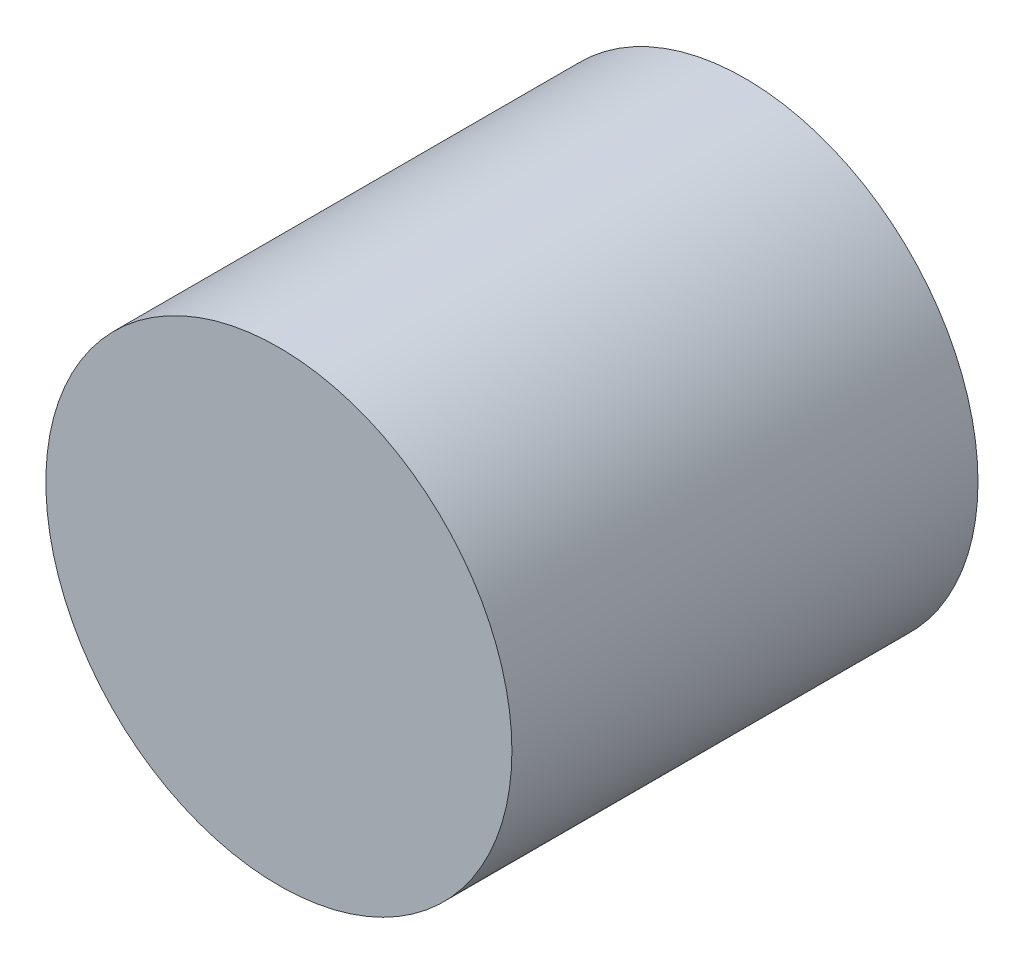
ISO-10303-21;
HEADER;
FILE_DESCRIPTION(('STEP AP214'),'2;1');
FILE_NAME('part.step','',(''),(''),'','','');
FILE_SCHEMA(('AUTOMOTIVE_DESIGN { 1 0 10303 214 1 1 1 1 }'));
ENDSEC;
DATA;
#1=APPLICATION_CONTEXT('core data for automotive mechanical design processes');
#2=APPLICATION_PROTOCOL_DEFINITION('international standard','automotive_design',2000,#1);
#3=PRODUCT_CONTEXT('',#1,'mechanical');
#4=PRODUCT('Part','Part','',(#3));
#5=PRODUCT_RELATED_PRODUCT_CATEGORY('part','',(#4));
#6=PRODUCT_DEFINITION_FORMATION('','',#4);
#7=PRODUCT_DEFINITION_CONTEXT('part definition',#1,'design');
#8=PRODUCT_DEFINITION('design','',#6,#7);
#9=PRODUCT_DEFINITION_SHAPE('','',#8);
#10=(LENGTH_UNIT() NAMED_UNIT(*) SI_UNIT(.MILLI.,.METRE.));
#11=(NAMED_UNIT(*) PLANE_ANGLE_UNIT() SI_UNIT($,.RADIAN.));
#12=(NAMED_UNIT(*) SI_UNIT($,.STERADIAN.) SOLID_ANGLE_UNIT());
#13=UNCERTAINTY_MEASURE_WITH_UNIT(LENGTH_MEASURE(1.E-05),#10,'distance_accuracy_value','');
#14=(GEOMETRIC_REPRESENTATION_CONTEXT(3) GLOBAL_UNCERTAINTY_ASSIGNED_CONTEXT((#13)) GLOBAL_UNIT_ASSIGNED_CONTEXT((#10,
#11,#12)) REPRESENTATION_CONTEXT('',''));
#15=CARTESIAN_POINT('',(0.,0.,0.));
#16=DIRECTION('',(0.,0.,1.));
#17=DIRECTION('',(1.,0.,0.));
#18=AXIS2_PLACEMENT_3D('',#15,#16,#17);
#19=CARTESIAN_POINT('',(0.,0.,3.5));
#20=DIRECTION('',(0.,0.,-1.));
#21=DIRECTION('',(-1.,0.,0.));
#22=AXIS2_PLACEMENT_3D('',#19,#20,#21);
#23=CYLINDRICAL_SURFACE('',#22,1.75);
#24=CARTESIAN_POINT('',(0.,0.,3.5));
#25=DIRECTION('',(0.,0.,1.));
#26=DIRECTION('',(1.,0.,0.));
#27=AXIS2_PLACEMENT_3D('',#24,#25,#26);
#28=CIRCLE('',#27,1.75);
#29=CARTESIAN_POINT('',(1.75,0.,3.5));
#30=VERTEX_POINT('',#29);
#31=EDGE_CURVE('E10',#30,#30,#28,.T.);
#32=ORIENTED_EDGE('',*,*,#31,.F.);
#33=EDGE_LOOP('',(#32));
#34=FACE_BOUND('',#33,.T.);
#35=CARTESIAN_POINT('',(0.,0.,0.));
#36=DIRECTION('',(0.,0.,1.));
#37=DIRECTION('',(1.,0.,0.));
#38=AXIS2_PLACEMENT_3D('',#35,#36,#37);
#39=CIRCLE('',#38,1.75);
#40=CARTESIAN_POINT('',(1.75,0.,0.));
#41=VERTEX_POINT('',#40);
#42=EDGE_CURVE('E34',#41,#41,#39,.T.);
#43=ORIENTED_EDGE('',*,*,#42,.T.);
#44=EDGE_LOOP('',(#43));
#45=FACE_BOUND('',#44,.T.);
#46=ADVANCED_FACE('F31',(#34,#45),#23,.T.);
#47=CARTESIAN_POINT('',(0.,0.,3.5));
#48=DIRECTION('',(0.,0.,1.));
#49=DIRECTION('',(1.,0.,0.));
#50=AXIS2_PLACEMENT_3D('',#47,#48,#49);
#51=PLANE('',#50);
#52=ORIENTED_EDGE('',*,*,#31,.T.);
#53=EDGE_LOOP('',(#52));
#54=FACE_BOUND('',#53,.T.);
#55=ADVANCED_FACE('F46',(#54),#51,.T.);
#56=CARTESIAN_POINT('',(0.,0.,0.));
#57=DIRECTION('',(0.,0.,1.));
#58=DIRECTION('',(1.,0.,0.));
#59=AXIS2_PLACEMENT_3D('',#56,#57,#58);
#60=PLANE('',#59);
#61=ORIENTED_EDGE('',*,*,#42,.F.);
#62=EDGE_LOOP('',(#61));
#63=FACE_BOUND('',#62,.T.);
#64=ADVANCED_FACE('F44',(#63),#60,.F.);
#65=CLOSED_SHELL('',(#46,#55,#64));
#66=MANIFOLD_SOLID_BREP('B2',#65);
#67=ADVANCED_BREP_SHAPE_REPRESENTATION('',(#18,#66),#14);
#68=SHAPE_DEFINITION_REPRESENTATION(#9,#67);
ENDSEC;
END-ISO-10303-21;
